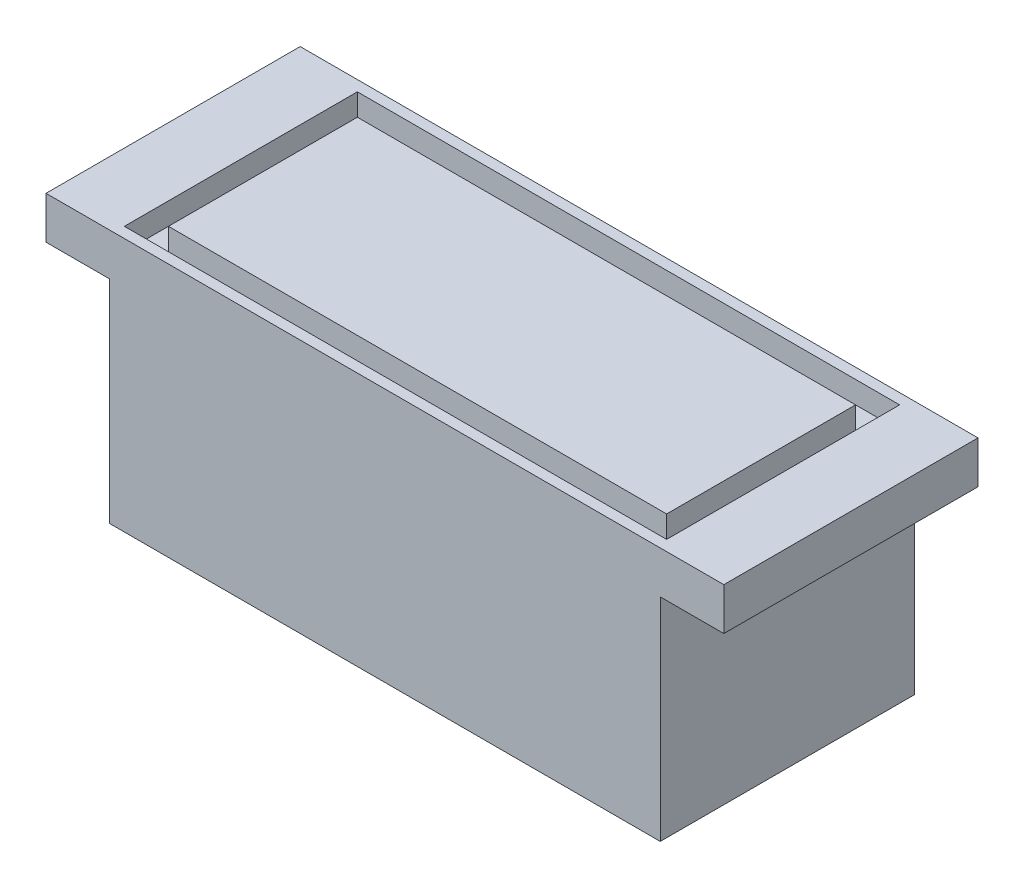
ISO-10303-21;
HEADER;
FILE_DESCRIPTION(('STEP AP214'),'2;1');
FILE_NAME('part.step','',(''),(''),'','','');
FILE_SCHEMA(('AUTOMOTIVE_DESIGN { 1 0 10303 214 1 1 1 1 }'));
ENDSEC;
DATA;
#1=APPLICATION_CONTEXT('core data for automotive mechanical design processes');
#2=APPLICATION_PROTOCOL_DEFINITION('international standard','automotive_design',2000,#1);
#3=PRODUCT_CONTEXT('',#1,'mechanical');
#4=PRODUCT('Part','Part','',(#3));
#5=PRODUCT_RELATED_PRODUCT_CATEGORY('part','',(#4));
#6=PRODUCT_DEFINITION_FORMATION('','',#4);
#7=PRODUCT_DEFINITION_CONTEXT('part definition',#1,'design');
#8=PRODUCT_DEFINITION('design','',#6,#7);
#9=PRODUCT_DEFINITION_SHAPE('','',#8);
#10=(LENGTH_UNIT() NAMED_UNIT(*) SI_UNIT(.MILLI.,.METRE.));
#11=(NAMED_UNIT(*) PLANE_ANGLE_UNIT() SI_UNIT($,.RADIAN.));
#12=(NAMED_UNIT(*) SI_UNIT($,.STERADIAN.) SOLID_ANGLE_UNIT());
#13=UNCERTAINTY_MEASURE_WITH_UNIT(LENGTH_MEASURE(1.E-05),#10,'distance_accuracy_value','');
#14=(GEOMETRIC_REPRESENTATION_CONTEXT(3) GLOBAL_UNCERTAINTY_ASSIGNED_CONTEXT((#13)) GLOBAL_UNIT_ASSIGNED_CONTEXT((#10,
#11,#12)) REPRESENTATION_CONTEXT('',''));
#15=CARTESIAN_POINT('',(0.,0.,0.));
#16=DIRECTION('',(0.,0.,1.));
#17=DIRECTION('',(1.,0.,0.));
#18=AXIS2_PLACEMENT_3D('',#15,#16,#17);
#19=CARTESIAN_POINT('',(50.8,0.,38.1));
#20=DIRECTION('',(0.,-1.,0.));
#21=DIRECTION('',(0.,0.,-1.));
#22=AXIS2_PLACEMENT_3D('',#19,#20,#21);
#23=PLANE('',#22);
#24=DIRECTION('',(-1.,0.,0.));
#25=VECTOR('',#24,1.);
#26=CARTESIAN_POINT('',(50.8,0.,0.));
#27=LINE('',#26,#25);
#28=CARTESIAN_POINT('',(50.8,0.,0.));
#29=VERTEX_POINT('',#28);
#30=CARTESIAN_POINT('',(-50.8,0.,0.));
#31=VERTEX_POINT('',#30);
#32=EDGE_CURVE('E295',#29,#31,#27,.T.);
#33=ORIENTED_EDGE('',*,*,#32,.T.);
#34=DIRECTION('',(0.,0.,-1.));
#35=VECTOR('',#34,1.);
#36=CARTESIAN_POINT('',(-50.8,0.,38.1));
#37=LINE('',#36,#35);
#38=CARTESIAN_POINT('',(-50.8,0.,38.1));
#39=VERTEX_POINT('',#38);
#40=EDGE_CURVE('E310',#39,#31,#37,.T.);
#41=ORIENTED_EDGE('',*,*,#40,.F.);
#42=DIRECTION('',(-1.,0.,0.));
#43=VECTOR('',#42,1.);
#44=CARTESIAN_POINT('',(50.8,0.,38.1));
#45=LINE('',#44,#43);
#46=CARTESIAN_POINT('',(50.8,0.,38.1));
#47=VERTEX_POINT('',#46);
#48=EDGE_CURVE('E266',#47,#39,#45,.T.);
#49=ORIENTED_EDGE('',*,*,#48,.F.);
#50=DIRECTION('',(0.,0.,-1.));
#51=VECTOR('',#50,1.);
#52=CARTESIAN_POINT('',(50.8,0.,38.1));
#53=LINE('',#52,#51);
#54=EDGE_CURVE('E314',#47,#29,#53,.T.);
#55=ORIENTED_EDGE('',*,*,#54,.T.);
#56=EDGE_LOOP('',(#33,#41,#49,#55));
#57=FACE_BOUND('',#56,.T.);
#58=DIRECTION('',(0.,0.,-1.));
#59=VECTOR('',#58,1.);
#60=CARTESIAN_POINT('',(-40.64,0.,0.));
#61=LINE('',#60,#59);
#62=CARTESIAN_POINT('',(-40.64,0.,36.5125));
#63=VERTEX_POINT('',#62);
#64=CARTESIAN_POINT('',(-40.64,0.,1.5875));
#65=VERTEX_POINT('',#64);
#66=EDGE_CURVE('E63',#63,#65,#61,.T.);
#67=ORIENTED_EDGE('',*,*,#66,.T.);
#68=DIRECTION('',(1.,0.,0.));
#69=VECTOR('',#68,1.);
#70=CARTESIAN_POINT('',(0.,0.,1.5875));
#71=LINE('',#70,#69);
#72=CARTESIAN_POINT('',(40.64,0.,1.5875));
#73=VERTEX_POINT('',#72);
#74=EDGE_CURVE('E175',#65,#73,#71,.T.);
#75=ORIENTED_EDGE('',*,*,#74,.T.);
#76=DIRECTION('',(0.,0.,1.));
#77=VECTOR('',#76,1.);
#78=CARTESIAN_POINT('',(40.64,0.,0.));
#79=LINE('',#78,#77);
#80=CARTESIAN_POINT('',(40.64,0.,36.5125));
#81=VERTEX_POINT('',#80);
#82=EDGE_CURVE('E218',#73,#81,#79,.T.);
#83=ORIENTED_EDGE('',*,*,#82,.T.);
#84=DIRECTION('',(-1.,0.,0.));
#85=VECTOR('',#84,1.);
#86=CARTESIAN_POINT('',(0.,0.,36.5125));
#87=LINE('',#86,#85);
#88=EDGE_CURVE('E214',#81,#63,#87,.T.);
#89=ORIENTED_EDGE('',*,*,#88,.T.);
#90=EDGE_LOOP('',(#67,#75,#83,#89));
#91=FACE_BOUND('',#90,.T.);
#92=ADVANCED_FACE('F39',(#57,#91),#23,.F.);
#93=CARTESIAN_POINT('',(-41.275,-6.35000000000002,38.1));
#94=DIRECTION('',(1.,0.,0.));
#95=DIRECTION('',(0.,1.,0.));
#96=AXIS2_PLACEMENT_3D('',#93,#94,#95);
#97=PLANE('',#96);
#98=DIRECTION('',(0.,-1.,0.));
#99=VECTOR('',#98,1.);
#100=CARTESIAN_POINT('',(-41.275,-6.35000000000002,0.));
#101=LINE('',#100,#99);
#102=CARTESIAN_POINT('',(-41.275,-6.35000000000002,0.));
#103=VERTEX_POINT('',#102);
#104=CARTESIAN_POINT('',(-41.275,-38.1,0.));
#105=VERTEX_POINT('',#104);
#106=EDGE_CURVE('E228',#103,#105,#101,.T.);
#107=ORIENTED_EDGE('',*,*,#106,.T.);
#108=DIRECTION('',(0.,0.,-1.));
#109=VECTOR('',#108,1.);
#110=CARTESIAN_POINT('',(-41.275,-38.1,38.1));
#111=LINE('',#110,#109);
#112=CARTESIAN_POINT('',(-41.275,-38.1,38.1));
#113=VERTEX_POINT('',#112);
#114=EDGE_CURVE('E11',#113,#105,#111,.T.);
#115=ORIENTED_EDGE('',*,*,#114,.F.);
#116=DIRECTION('',(0.,-1.,0.));
#117=VECTOR('',#116,1.);
#118=CARTESIAN_POINT('',(-41.275,-6.35000000000002,38.1));
#119=LINE('',#118,#117);
#120=CARTESIAN_POINT('',(-41.275,-6.35000000000002,38.1));
#121=VERTEX_POINT('',#120);
#122=EDGE_CURVE('E246',#121,#113,#119,.T.);
#123=ORIENTED_EDGE('',*,*,#122,.F.);
#124=DIRECTION('',(0.,0.,-1.));
#125=VECTOR('',#124,1.);
#126=CARTESIAN_POINT('',(-41.275,-6.35000000000002,38.1));
#127=LINE('',#126,#125);
#128=EDGE_CURVE('E275',#121,#103,#127,.T.);
#129=ORIENTED_EDGE('',*,*,#128,.T.);
#130=EDGE_LOOP('',(#107,#115,#123,#129));
#131=FACE_BOUND('',#130,.T.);
#132=ADVANCED_FACE('F41',(#131),#97,.F.);
#133=CARTESIAN_POINT('',(-41.275,-38.1,38.1));
#134=DIRECTION('',(0.,1.,0.));
#135=DIRECTION('',(0.,0.,1.));
#136=AXIS2_PLACEMENT_3D('',#133,#134,#135);
#137=PLANE('',#136);
#138=DIRECTION('',(1.,0.,0.));
#139=VECTOR('',#138,1.);
#140=CARTESIAN_POINT('',(-41.275,-38.1,0.));
#141=LINE('',#140,#139);
#142=CARTESIAN_POINT('',(41.275,-38.1,0.));
#143=VERTEX_POINT('',#142);
#144=EDGE_CURVE('E279',#105,#143,#141,.T.);
#145=ORIENTED_EDGE('',*,*,#144,.T.);
#146=DIRECTION('',(0.,0.,-1.));
#147=VECTOR('',#146,1.);
#148=CARTESIAN_POINT('',(41.275,-38.1,38.1));
#149=LINE('',#148,#147);
#150=CARTESIAN_POINT('',(41.275,-38.1,38.1));
#151=VERTEX_POINT('',#150);
#152=EDGE_CURVE('E48',#151,#143,#149,.T.);
#153=ORIENTED_EDGE('',*,*,#152,.F.);
#154=DIRECTION('',(1.,0.,0.));
#155=VECTOR('',#154,1.);
#156=CARTESIAN_POINT('',(-41.275,-38.1,38.1));
#157=LINE('',#156,#155);
#158=EDGE_CURVE('E250',#113,#151,#157,.T.);
#159=ORIENTED_EDGE('',*,*,#158,.F.);
#160=ORIENTED_EDGE('',*,*,#114,.T.);
#161=EDGE_LOOP('',(#145,#153,#159,#160));
#162=FACE_BOUND('',#161,.T.);
#163=ADVANCED_FACE('F329',(#162),#137,.F.);
#164=CARTESIAN_POINT('',(41.275,-6.35000000000002,38.1));
#165=DIRECTION('',(1.,0.,0.));
#166=DIRECTION('',(0.,1.,0.));
#167=AXIS2_PLACEMENT_3D('',#164,#165,#166);
#168=PLANE('',#167);
#169=DIRECTION('',(0.,-1.,0.));
#170=VECTOR('',#169,1.);
#171=CARTESIAN_POINT('',(41.275,-6.35000000000002,0.));
#172=LINE('',#171,#170);
#173=CARTESIAN_POINT('',(41.275,-6.35000000000002,0.));
#174=VERTEX_POINT('',#173);
#175=EDGE_CURVE('E283',#174,#143,#172,.T.);
#176=ORIENTED_EDGE('',*,*,#175,.F.);
#177=DIRECTION('',(0.,0.,-1.));
#178=VECTOR('',#177,1.);
#179=CARTESIAN_POINT('',(41.275,-6.35000000000002,38.1));
#180=LINE('',#179,#178);
#181=CARTESIAN_POINT('',(41.275,-6.35000000000002,38.1));
#182=VERTEX_POINT('',#181);
#183=EDGE_CURVE('E320',#182,#174,#180,.T.);
#184=ORIENTED_EDGE('',*,*,#183,.F.);
#185=DIRECTION('',(0.,-1.,0.));
#186=VECTOR('',#185,1.);
#187=CARTESIAN_POINT('',(41.275,-6.35000000000002,38.1));
#188=LINE('',#187,#186);
#189=EDGE_CURVE('E254',#182,#151,#188,.T.);
#190=ORIENTED_EDGE('',*,*,#189,.T.);
#191=ORIENTED_EDGE('',*,*,#152,.T.);
#192=EDGE_LOOP('',(#176,#184,#190,#191));
#193=FACE_BOUND('',#192,.T.);
#194=ADVANCED_FACE('F326',(#193),#168,.T.);
#195=CARTESIAN_POINT('',(50.8,-6.35000000000002,38.1));
#196=DIRECTION('',(0.,-1.,0.));
#197=DIRECTION('',(0.,0.,-1.));
#198=AXIS2_PLACEMENT_3D('',#195,#196,#197);
#199=PLANE('',#198);
#200=DIRECTION('',(-1.,0.,0.));
#201=VECTOR('',#200,1.);
#202=CARTESIAN_POINT('',(50.8,-6.35000000000002,0.));
#203=LINE('',#202,#201);
#204=CARTESIAN_POINT('',(50.8,-6.35000000000002,0.));
#205=VERTEX_POINT('',#204);
#206=EDGE_CURVE('E287',#205,#174,#203,.T.);
#207=ORIENTED_EDGE('',*,*,#206,.F.);
#208=DIRECTION('',(0.,0.,-1.));
#209=VECTOR('',#208,1.);
#210=CARTESIAN_POINT('',(50.8,-6.35000000000002,38.1));
#211=LINE('',#210,#209);
#212=CARTESIAN_POINT('',(50.8,-6.35000000000002,38.1));
#213=VERTEX_POINT('',#212);
#214=EDGE_CURVE('E317',#213,#205,#211,.T.);
#215=ORIENTED_EDGE('',*,*,#214,.F.);
#216=DIRECTION('',(-1.,0.,0.));
#217=VECTOR('',#216,1.);
#218=CARTESIAN_POINT('',(50.8,-6.35000000000002,38.1));
#219=LINE('',#218,#217);
#220=EDGE_CURVE('E258',#213,#182,#219,.T.);
#221=ORIENTED_EDGE('',*,*,#220,.T.);
#222=ORIENTED_EDGE('',*,*,#183,.T.);
#223=EDGE_LOOP('',(#207,#215,#221,#222));
#224=FACE_BOUND('',#223,.T.);
#225=ADVANCED_FACE('F338',(#224),#199,.T.);
#226=CARTESIAN_POINT('',(50.8,0.,38.1));
#227=DIRECTION('',(1.,0.,0.));
#228=DIRECTION('',(0.,1.,0.));
#229=AXIS2_PLACEMENT_3D('',#226,#227,#228);
#230=PLANE('',#229);
#231=DIRECTION('',(0.,-1.,0.));
#232=VECTOR('',#231,1.);
#233=CARTESIAN_POINT('',(50.8,0.,0.));
#234=LINE('',#233,#232);
#235=EDGE_CURVE('E291',#29,#205,#234,.T.);
#236=ORIENTED_EDGE('',*,*,#235,.F.);
#237=ORIENTED_EDGE('',*,*,#54,.F.);
#238=DIRECTION('',(0.,-1.,0.));
#239=VECTOR('',#238,1.);
#240=CARTESIAN_POINT('',(50.8,0.,38.1));
#241=LINE('',#240,#239);
#242=EDGE_CURVE('E262',#47,#213,#241,.T.);
#243=ORIENTED_EDGE('',*,*,#242,.T.);
#244=ORIENTED_EDGE('',*,*,#214,.T.);
#245=EDGE_LOOP('',(#236,#237,#243,#244));
#246=FACE_BOUND('',#245,.T.);
#247=ADVANCED_FACE('F360',(#246),#230,.T.);
#248=CARTESIAN_POINT('',(-50.8,0.,38.1));
#249=DIRECTION('',(1.,0.,0.));
#250=DIRECTION('',(0.,1.,0.));
#251=AXIS2_PLACEMENT_3D('',#248,#249,#250);
#252=PLANE('',#251);
#253=DIRECTION('',(0.,-1.,0.));
#254=VECTOR('',#253,1.);
#255=CARTESIAN_POINT('',(-50.8,0.,0.));
#256=LINE('',#255,#254);
#257=CARTESIAN_POINT('',(-50.8,-6.35000000000002,0.));
#258=VERTEX_POINT('',#257);
#259=EDGE_CURVE('E298',#31,#258,#256,.T.);
#260=ORIENTED_EDGE('',*,*,#259,.T.);
#261=DIRECTION('',(0.,0.,-1.));
#262=VECTOR('',#261,1.);
#263=CARTESIAN_POINT('',(-50.8,-6.35000000000002,38.1));
#264=LINE('',#263,#262);
#265=CARTESIAN_POINT('',(-50.8,-6.35000000000002,38.1));
#266=VERTEX_POINT('',#265);
#267=EDGE_CURVE('E306',#266,#258,#264,.T.);
#268=ORIENTED_EDGE('',*,*,#267,.F.);
#269=DIRECTION('',(0.,-1.,0.));
#270=VECTOR('',#269,1.);
#271=CARTESIAN_POINT('',(-50.8,0.,38.1));
#272=LINE('',#271,#270);
#273=EDGE_CURVE('E269',#39,#266,#272,.T.);
#274=ORIENTED_EDGE('',*,*,#273,.F.);
#275=ORIENTED_EDGE('',*,*,#40,.T.);
#276=EDGE_LOOP('',(#260,#268,#274,#275));
#277=FACE_BOUND('',#276,.T.);
#278=ADVANCED_FACE('F354',(#277),#252,.F.);
#279=CARTESIAN_POINT('',(-50.8,-6.35000000000002,38.1));
#280=DIRECTION('',(0.,1.,0.));
#281=DIRECTION('',(0.,0.,1.));
#282=AXIS2_PLACEMENT_3D('',#279,#280,#281);
#283=PLANE('',#282);
#284=DIRECTION('',(1.,0.,0.));
#285=VECTOR('',#284,1.);
#286=CARTESIAN_POINT('',(-50.8,-6.35000000000002,0.));
#287=LINE('',#286,#285);
#288=EDGE_CURVE('E251',#258,#103,#287,.T.);
#289=ORIENTED_EDGE('',*,*,#288,.T.);
#290=ORIENTED_EDGE('',*,*,#128,.F.);
#291=DIRECTION('',(1.,0.,0.));
#292=VECTOR('',#291,1.);
#293=CARTESIAN_POINT('',(-50.8,-6.35000000000002,38.1));
#294=LINE('',#293,#292);
#295=EDGE_CURVE('E272',#266,#121,#294,.T.);
#296=ORIENTED_EDGE('',*,*,#295,.F.);
#297=ORIENTED_EDGE('',*,*,#267,.T.);
#298=EDGE_LOOP('',(#289,#290,#296,#297));
#299=FACE_BOUND('',#298,.T.);
#300=ADVANCED_FACE('F350',(#299),#283,.F.);
#301=CARTESIAN_POINT('',(0.,0.,38.1));
#302=DIRECTION('',(0.,0.,1.));
#303=DIRECTION('',(1.,0.,0.));
#304=AXIS2_PLACEMENT_3D('',#301,#302,#303);
#305=PLANE('',#304);
#306=ORIENTED_EDGE('',*,*,#122,.T.);
#307=ORIENTED_EDGE('',*,*,#158,.T.);
#308=ORIENTED_EDGE('',*,*,#189,.F.);
#309=ORIENTED_EDGE('',*,*,#220,.F.);
#310=ORIENTED_EDGE('',*,*,#242,.F.);
#311=ORIENTED_EDGE('',*,*,#48,.T.);
#312=ORIENTED_EDGE('',*,*,#273,.T.);
#313=ORIENTED_EDGE('',*,*,#295,.T.);
#314=EDGE_LOOP('',(#306,#307,#308,#309,#310,#311,#312,#313));
#315=FACE_BOUND('',#314,.T.);
#316=ADVANCED_FACE('F341',(#315),#305,.T.);
#317=CARTESIAN_POINT('',(0.,0.,0.));
#318=DIRECTION('',(0.,0.,1.));
#319=DIRECTION('',(1.,0.,0.));
#320=AXIS2_PLACEMENT_3D('',#317,#318,#319);
#321=PLANE('',#320);
#322=ORIENTED_EDGE('',*,*,#106,.F.);
#323=ORIENTED_EDGE('',*,*,#288,.F.);
#324=ORIENTED_EDGE('',*,*,#259,.F.);
#325=ORIENTED_EDGE('',*,*,#32,.F.);
#326=ORIENTED_EDGE('',*,*,#235,.T.);
#327=ORIENTED_EDGE('',*,*,#206,.T.);
#328=ORIENTED_EDGE('',*,*,#175,.T.);
#329=ORIENTED_EDGE('',*,*,#144,.F.);
#330=EDGE_LOOP('',(#322,#323,#324,#325,#326,#327,#328,#329));
#331=FACE_BOUND('',#330,.T.);
#332=ADVANCED_FACE('F333',(#331),#321,.F.);
#333=CARTESIAN_POINT('',(-40.64,-3.302,0.));
#334=DIRECTION('',(1.,0.,0.));
#335=DIRECTION('',(0.,0.,-1.));
#336=AXIS2_PLACEMENT_3D('',#333,#334,#335);
#337=PLANE('',#336);
#338=ORIENTED_EDGE('',*,*,#66,.F.);
#339=DIRECTION('',(0.,1.,0.));
#340=VECTOR('',#339,1.);
#341=CARTESIAN_POINT('',(-40.64,-3.302,36.5125));
#342=LINE('',#341,#340);
#343=CARTESIAN_POINT('',(-40.64,-3.302,36.5125));
#344=VERTEX_POINT('',#343);
#345=EDGE_CURVE('E235',#344,#63,#342,.T.);
#346=ORIENTED_EDGE('',*,*,#345,.F.);
#347=DIRECTION('',(0.,0.,-1.));
#348=VECTOR('',#347,1.);
#349=CARTESIAN_POINT('',(-40.64,-3.302,0.));
#350=LINE('',#349,#348);
#351=CARTESIAN_POINT('',(-40.64,-3.302,1.5875));
#352=VERTEX_POINT('',#351);
#353=EDGE_CURVE('E187',#344,#352,#350,.T.);
#354=ORIENTED_EDGE('',*,*,#353,.T.);
#355=DIRECTION('',(0.,1.,0.));
#356=VECTOR('',#355,1.);
#357=CARTESIAN_POINT('',(-40.64,-3.302,1.5875));
#358=LINE('',#357,#356);
#359=EDGE_CURVE('E225',#352,#65,#358,.T.);
#360=ORIENTED_EDGE('',*,*,#359,.T.);
#361=EDGE_LOOP('',(#338,#346,#354,#360));
#362=FACE_BOUND('',#361,.T.);
#363=ADVANCED_FACE('F398',(#362),#337,.T.);
#364=CARTESIAN_POINT('',(0.,-3.302,1.5875));
#365=DIRECTION('',(0.,0.,1.));
#366=DIRECTION('',(1.,0.,0.));
#367=AXIS2_PLACEMENT_3D('',#364,#365,#366);
#368=PLANE('',#367);
#369=ORIENTED_EDGE('',*,*,#74,.F.);
#370=ORIENTED_EDGE('',*,*,#359,.F.);
#371=DIRECTION('',(1.,0.,0.));
#372=VECTOR('',#371,1.);
#373=CARTESIAN_POINT('',(0.,-3.302,1.5875));
#374=LINE('',#373,#372);
#375=CARTESIAN_POINT('',(40.64,-3.302,1.5875));
#376=VERTEX_POINT('',#375);
#377=EDGE_CURVE('E163',#352,#376,#374,.T.);
#378=ORIENTED_EDGE('',*,*,#377,.T.);
#379=DIRECTION('',(0.,1.,0.));
#380=VECTOR('',#379,1.);
#381=CARTESIAN_POINT('',(40.64,-3.302,1.5875));
#382=LINE('',#381,#380);
#383=EDGE_CURVE('E229',#376,#73,#382,.T.);
#384=ORIENTED_EDGE('',*,*,#383,.T.);
#385=EDGE_LOOP('',(#369,#370,#378,#384));
#386=FACE_BOUND('',#385,.T.);
#387=ADVANCED_FACE('F426',(#386),#368,.T.);
#388=CARTESIAN_POINT('',(40.64,-3.302,0.));
#389=DIRECTION('',(-1.,0.,0.));
#390=DIRECTION('',(0.,0.,1.));
#391=AXIS2_PLACEMENT_3D('',#388,#389,#390);
#392=PLANE('',#391);
#393=ORIENTED_EDGE('',*,*,#82,.F.);
#394=ORIENTED_EDGE('',*,*,#383,.F.);
#395=DIRECTION('',(0.,0.,1.));
#396=VECTOR('',#395,1.);
#397=CARTESIAN_POINT('',(40.64,-3.302,0.));
#398=LINE('',#397,#396);
#399=CARTESIAN_POINT('',(40.64,-3.302,36.5125));
#400=VERTEX_POINT('',#399);
#401=EDGE_CURVE('E194',#376,#400,#398,.T.);
#402=ORIENTED_EDGE('',*,*,#401,.T.);
#403=DIRECTION('',(0.,1.,0.));
#404=VECTOR('',#403,1.);
#405=CARTESIAN_POINT('',(40.64,-3.302,36.5125));
#406=LINE('',#405,#404);
#407=EDGE_CURVE('E232',#400,#81,#406,.T.);
#408=ORIENTED_EDGE('',*,*,#407,.T.);
#409=EDGE_LOOP('',(#393,#394,#402,#408));
#410=FACE_BOUND('',#409,.T.);
#411=ADVANCED_FACE('F395',(#410),#392,.T.);
#412=CARTESIAN_POINT('',(-37.338,-3.302,0.));
#413=DIRECTION('',(-1.,0.,0.));
#414=DIRECTION('',(0.,0.,1.));
#415=AXIS2_PLACEMENT_3D('',#412,#413,#414);
#416=PLANE('',#415);
#417=DIRECTION('',(0.,0.,1.));
#418=VECTOR('',#417,1.);
#419=CARTESIAN_POINT('',(-37.338,0.,0.));
#420=LINE('',#419,#418);
#421=CARTESIAN_POINT('',(-37.338,0.,4.88950000000001));
#422=VERTEX_POINT('',#421);
#423=CARTESIAN_POINT('',(-37.338,0.,33.2105));
#424=VERTEX_POINT('',#423);
#425=EDGE_CURVE('E55',#422,#424,#420,.T.);
#426=ORIENTED_EDGE('',*,*,#425,.F.);
#427=DIRECTION('',(0.,1.,0.));
#428=VECTOR('',#427,1.);
#429=CARTESIAN_POINT('',(-37.338,-3.302,4.8895));
#430=LINE('',#429,#428);
#431=CARTESIAN_POINT('',(-37.338,-3.302,4.8895));
#432=VERTEX_POINT('',#431);
#433=EDGE_CURVE('E152',#432,#422,#430,.T.);
#434=ORIENTED_EDGE('',*,*,#433,.F.);
#435=DIRECTION('',(0.,0.,1.));
#436=VECTOR('',#435,1.);
#437=CARTESIAN_POINT('',(-37.338,-3.302,0.));
#438=LINE('',#437,#436);
#439=CARTESIAN_POINT('',(-37.338,-3.302,33.2105));
#440=VERTEX_POINT('',#439);
#441=EDGE_CURVE('E155',#432,#440,#438,.T.);
#442=ORIENTED_EDGE('',*,*,#441,.T.);
#443=DIRECTION('',(0.,1.,0.));
#444=VECTOR('',#443,1.);
#445=CARTESIAN_POINT('',(-37.338,-3.302,33.2105));
#446=LINE('',#445,#444);
#447=EDGE_CURVE('E238',#440,#424,#446,.T.);
#448=ORIENTED_EDGE('',*,*,#447,.T.);
#449=EDGE_LOOP('',(#426,#434,#442,#448));
#450=FACE_BOUND('',#449,.T.);
#451=ADVANCED_FACE('F154',(#450),#416,.T.);
#452=CARTESIAN_POINT('',(0.,-3.302,33.2105));
#453=DIRECTION('',(0.,0.,-1.));
#454=DIRECTION('',(-1.,0.,0.));
#455=AXIS2_PLACEMENT_3D('',#452,#453,#454);
#456=PLANE('',#455);
#457=DIRECTION('',(-1.,0.,0.));
#458=VECTOR('',#457,1.);
#459=CARTESIAN_POINT('',(0.,0.,33.2105));
#460=LINE('',#459,#458);
#461=CARTESIAN_POINT('',(37.338,0.,33.2105));
#462=VERTEX_POINT('',#461);
#463=EDGE_CURVE('E208',#462,#424,#460,.T.);
#464=ORIENTED_EDGE('',*,*,#463,.T.);
#465=ORIENTED_EDGE('',*,*,#447,.F.);
#466=DIRECTION('',(-1.,0.,0.));
#467=VECTOR('',#466,1.);
#468=CARTESIAN_POINT('',(0.,-3.302,33.2105));
#469=LINE('',#468,#467);
#470=CARTESIAN_POINT('',(37.338,-3.302,33.2105));
#471=VERTEX_POINT('',#470);
#472=EDGE_CURVE('E173',#471,#440,#469,.T.);
#473=ORIENTED_EDGE('',*,*,#472,.F.);
#474=DIRECTION('',(0.,1.,0.));
#475=VECTOR('',#474,1.);
#476=CARTESIAN_POINT('',(37.338,-3.302,33.2105));
#477=LINE('',#476,#475);
#478=EDGE_CURVE('E241',#471,#462,#477,.T.);
#479=ORIENTED_EDGE('',*,*,#478,.T.);
#480=EDGE_LOOP('',(#464,#465,#473,#479));
#481=FACE_BOUND('',#480,.T.);
#482=ADVANCED_FACE('F387',(#481),#456,.F.);
#483=CARTESIAN_POINT('',(37.338,-3.302,0.));
#484=DIRECTION('',(-1.,0.,0.));
#485=DIRECTION('',(0.,0.,1.));
#486=AXIS2_PLACEMENT_3D('',#483,#484,#485);
#487=PLANE('',#486);
#488=DIRECTION('',(0.,0.,1.));
#489=VECTOR('',#488,1.);
#490=CARTESIAN_POINT('',(37.338,0.,0.));
#491=LINE('',#490,#489);
#492=CARTESIAN_POINT('',(37.338,0.,4.8895));
#493=VERTEX_POINT('',#492);
#494=EDGE_CURVE('E204',#493,#462,#491,.T.);
#495=ORIENTED_EDGE('',*,*,#494,.T.);
#496=ORIENTED_EDGE('',*,*,#478,.F.);
#497=DIRECTION('',(0.,0.,1.));
#498=VECTOR('',#497,1.);
#499=CARTESIAN_POINT('',(37.338,-3.302,0.));
#500=LINE('',#499,#498);
#501=CARTESIAN_POINT('',(37.338,-3.302,4.8895));
#502=VERTEX_POINT('',#501);
#503=EDGE_CURVE('E180',#502,#471,#500,.T.);
#504=ORIENTED_EDGE('',*,*,#503,.F.);
#505=DIRECTION('',(0.,1.,0.));
#506=VECTOR('',#505,1.);
#507=CARTESIAN_POINT('',(37.338,-3.302,4.8895));
#508=LINE('',#507,#506);
#509=EDGE_CURVE('E162',#502,#493,#508,.T.);
#510=ORIENTED_EDGE('',*,*,#509,.T.);
#511=EDGE_LOOP('',(#495,#496,#504,#510));
#512=FACE_BOUND('',#511,.T.);
#513=ADVANCED_FACE('F385',(#512),#487,.F.);
#514=CARTESIAN_POINT('',(0.,-3.302,4.8895));
#515=DIRECTION('',(0.,0.,1.));
#516=DIRECTION('',(1.,0.,0.));
#517=AXIS2_PLACEMENT_3D('',#514,#515,#516);
#518=PLANE('',#517);
#519=DIRECTION('',(1.,0.,0.));
#520=VECTOR('',#519,1.);
#521=CARTESIAN_POINT('',(0.,0.,4.8895));
#522=LINE('',#521,#520);
#523=EDGE_CURVE('E201',#422,#493,#522,.T.);
#524=ORIENTED_EDGE('',*,*,#523,.T.);
#525=ORIENTED_EDGE('',*,*,#509,.F.);
#526=DIRECTION('',(1.,0.,0.));
#527=VECTOR('',#526,1.);
#528=CARTESIAN_POINT('',(0.,-3.302,4.8895));
#529=LINE('',#528,#527);
#530=EDGE_CURVE('E171',#432,#502,#529,.T.);
#531=ORIENTED_EDGE('',*,*,#530,.F.);
#532=ORIENTED_EDGE('',*,*,#433,.T.);
#533=EDGE_LOOP('',(#524,#525,#531,#532));
#534=FACE_BOUND('',#533,.T.);
#535=ADVANCED_FACE('F177',(#534),#518,.F.);
#536=CARTESIAN_POINT('',(0.,-3.302,36.5125));
#537=DIRECTION('',(0.,0.,-1.));
#538=DIRECTION('',(-1.,0.,0.));
#539=AXIS2_PLACEMENT_3D('',#536,#537,#538);
#540=PLANE('',#539);
#541=ORIENTED_EDGE('',*,*,#88,.F.);
#542=ORIENTED_EDGE('',*,*,#407,.F.);
#543=DIRECTION('',(-1.,0.,0.));
#544=VECTOR('',#543,1.);
#545=CARTESIAN_POINT('',(0.,-3.302,36.5125));
#546=LINE('',#545,#544);
#547=EDGE_CURVE('E191',#400,#344,#546,.T.);
#548=ORIENTED_EDGE('',*,*,#547,.T.);
#549=ORIENTED_EDGE('',*,*,#345,.T.);
#550=EDGE_LOOP('',(#541,#542,#548,#549));
#551=FACE_BOUND('',#550,.T.);
#552=ADVANCED_FACE('F380',(#551),#540,.T.);
#553=CARTESIAN_POINT('',(0.,-3.302,0.));
#554=DIRECTION('',(0.,1.,0.));
#555=DIRECTION('',(0.,0.,1.));
#556=AXIS2_PLACEMENT_3D('',#553,#554,#555);
#557=PLANE('',#556);
#558=ORIENTED_EDGE('',*,*,#441,.F.);
#559=ORIENTED_EDGE('',*,*,#530,.T.);
#560=ORIENTED_EDGE('',*,*,#503,.T.);
#561=ORIENTED_EDGE('',*,*,#472,.T.);
#562=EDGE_LOOP('',(#558,#559,#560,#561));
#563=FACE_BOUND('',#562,.T.);
#564=ORIENTED_EDGE('',*,*,#353,.F.);
#565=ORIENTED_EDGE('',*,*,#547,.F.);
#566=ORIENTED_EDGE('',*,*,#401,.F.);
#567=ORIENTED_EDGE('',*,*,#377,.F.);
#568=EDGE_LOOP('',(#564,#565,#566,#567));
#569=FACE_BOUND('',#568,.T.);
#570=ADVANCED_FACE('F168',(#563,#569),#557,.T.);
#571=ORIENTED_EDGE('',*,*,#425,.T.);
#572=ORIENTED_EDGE('',*,*,#463,.F.);
#573=ORIENTED_EDGE('',*,*,#494,.F.);
#574=ORIENTED_EDGE('',*,*,#523,.F.);
#575=EDGE_LOOP('',(#571,#572,#573,#574));
#576=FACE_BOUND('',#575,.T.);
#577=ADVANCED_FACE('F371',(#576),#23,.F.);
#578=CLOSED_SHELL('',(#92,#132,#163,#194,#225,#247,#278,#300,#316,#332,#363,#387,#411,#451,#482,
#513,#535,#552,#570,#577));
#579=MANIFOLD_SOLID_BREP('B2',#578);
#580=ADVANCED_BREP_SHAPE_REPRESENTATION('',(#18,#579),#14);
#581=SHAPE_DEFINITION_REPRESENTATION(#9,#580);
ENDSEC;
END-ISO-10303-21;
